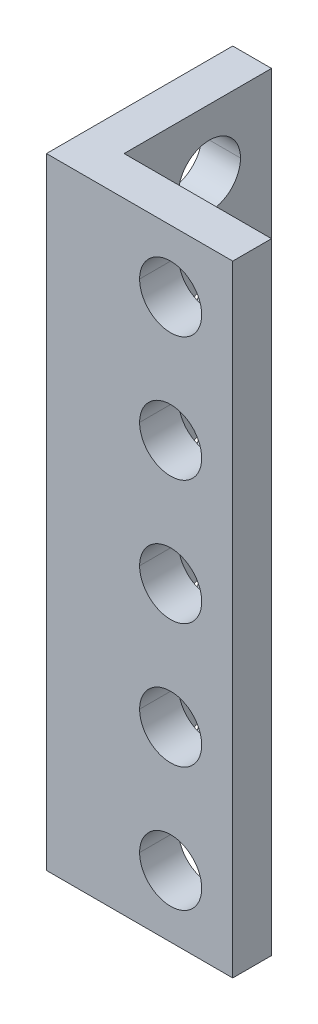
ISO-10303-21;
HEADER;
FILE_DESCRIPTION(('STEP AP214'),'2;1');
FILE_NAME('part.step','',(''),(''),'','','');
FILE_SCHEMA(('AUTOMOTIVE_DESIGN { 1 0 10303 214 1 1 1 1 }'));
ENDSEC;
DATA;
#1=APPLICATION_CONTEXT('core data for automotive mechanical design processes');
#2=APPLICATION_PROTOCOL_DEFINITION('international standard','automotive_design',2000,#1);
#3=PRODUCT_CONTEXT('',#1,'mechanical');
#4=PRODUCT('Part','Part','',(#3));
#5=PRODUCT_RELATED_PRODUCT_CATEGORY('part','',(#4));
#6=PRODUCT_DEFINITION_FORMATION('','',#4);
#7=PRODUCT_DEFINITION_CONTEXT('part definition',#1,'design');
#8=PRODUCT_DEFINITION('design','',#6,#7);
#9=PRODUCT_DEFINITION_SHAPE('','',#8);
#10=(LENGTH_UNIT() NAMED_UNIT(*) SI_UNIT(.MILLI.,.METRE.));
#11=(NAMED_UNIT(*) PLANE_ANGLE_UNIT() SI_UNIT($,.RADIAN.));
#12=(NAMED_UNIT(*) SI_UNIT($,.STERADIAN.) SOLID_ANGLE_UNIT());
#13=UNCERTAINTY_MEASURE_WITH_UNIT(LENGTH_MEASURE(1.E-05),#10,'distance_accuracy_value','');
#14=(GEOMETRIC_REPRESENTATION_CONTEXT(3) GLOBAL_UNCERTAINTY_ASSIGNED_CONTEXT((#13)) GLOBAL_UNIT_ASSIGNED_CONTEXT((#10,
#11,#12)) REPRESENTATION_CONTEXT('',''));
#15=CARTESIAN_POINT('',(0.,0.,0.));
#16=DIRECTION('',(0.,0.,1.));
#17=DIRECTION('',(1.,0.,0.));
#18=AXIS2_PLACEMENT_3D('',#15,#16,#17);
#19=CARTESIAN_POINT('',(12.,36.,-8.));
#20=DIRECTION('',(-1.,0.,0.));
#21=DIRECTION('',(0.,0.,1.));
#22=AXIS2_PLACEMENT_3D('',#19,#20,#21);
#23=CYLINDRICAL_SURFACE('',#22,2.);
#24=DIRECTION('',(-1.,0.,0.));
#25=VECTOR('',#24,1.);
#26=CARTESIAN_POINT('',(12.,36.,-10.));
#27=LINE('',#26,#25);
#28=CARTESIAN_POINT('',(2.5,36.,-10.));
#29=VERTEX_POINT('',#28);
#30=CARTESIAN_POINT('',(0.,36.,-10.));
#31=VERTEX_POINT('',#30);
#32=EDGE_CURVE('E372',#29,#31,#27,.T.);
#33=ORIENTED_EDGE('',*,*,#32,.F.);
#34=CARTESIAN_POINT('',(2.5,36.,-8.));
#35=DIRECTION('',(-1.,0.,0.));
#36=DIRECTION('',(0.,0.,1.));
#37=AXIS2_PLACEMENT_3D('',#34,#35,#36);
#38=CIRCLE('',#37,2.);
#39=CARTESIAN_POINT('',(2.5,36.,-6.));
#40=VERTEX_POINT('',#39);
#41=EDGE_CURVE('E350',#40,#29,#38,.T.);
#42=ORIENTED_EDGE('',*,*,#41,.F.);
#43=DIRECTION('',(-1.,0.,0.));
#44=VECTOR('',#43,1.);
#45=CARTESIAN_POINT('',(12.,36.,-6.));
#46=LINE('',#45,#44);
#47=CARTESIAN_POINT('',(0.,36.,-6.));
#48=VERTEX_POINT('',#47);
#49=EDGE_CURVE('E486',#40,#48,#46,.T.);
#50=ORIENTED_EDGE('',*,*,#49,.T.);
#51=CARTESIAN_POINT('',(0.,36.,-8.));
#52=DIRECTION('',(-1.,0.,0.));
#53=DIRECTION('',(0.,0.,1.));
#54=AXIS2_PLACEMENT_3D('',#51,#52,#53);
#55=CIRCLE('',#54,2.);
#56=EDGE_CURVE('E357',#48,#31,#55,.T.);
#57=ORIENTED_EDGE('',*,*,#56,.T.);
#58=EDGE_LOOP('',(#33,#42,#50,#57));
#59=FACE_BOUND('',#58,.T.);
#60=ADVANCED_FACE('F14',(#59),#23,.F.);
#61=CARTESIAN_POINT('',(12.,28.,-8.));
#62=DIRECTION('',(-1.,0.,0.));
#63=DIRECTION('',(0.,0.,1.));
#64=AXIS2_PLACEMENT_3D('',#61,#62,#63);
#65=CYLINDRICAL_SURFACE('',#64,2.);
#66=DIRECTION('',(-1.,0.,0.));
#67=VECTOR('',#66,1.);
#68=CARTESIAN_POINT('',(12.,28.,-10.));
#69=LINE('',#68,#67);
#70=CARTESIAN_POINT('',(2.5,28.,-10.));
#71=VERTEX_POINT('',#70);
#72=CARTESIAN_POINT('',(0.,28.,-10.));
#73=VERTEX_POINT('',#72);
#74=EDGE_CURVE('E358',#71,#73,#69,.T.);
#75=ORIENTED_EDGE('',*,*,#74,.F.);
#76=CARTESIAN_POINT('',(2.5,28.,-8.));
#77=DIRECTION('',(-1.,0.,0.));
#78=DIRECTION('',(0.,0.,1.));
#79=AXIS2_PLACEMENT_3D('',#76,#77,#78);
#80=CIRCLE('',#79,2.);
#81=CARTESIAN_POINT('',(2.5,28.,-6.));
#82=VERTEX_POINT('',#81);
#83=EDGE_CURVE('E287',#82,#71,#80,.T.);
#84=ORIENTED_EDGE('',*,*,#83,.F.);
#85=DIRECTION('',(-1.,0.,0.));
#86=VECTOR('',#85,1.);
#87=CARTESIAN_POINT('',(12.,28.,-6.));
#88=LINE('',#87,#86);
#89=CARTESIAN_POINT('',(0.,28.,-6.));
#90=VERTEX_POINT('',#89);
#91=EDGE_CURVE('E364',#82,#90,#88,.T.);
#92=ORIENTED_EDGE('',*,*,#91,.T.);
#93=CARTESIAN_POINT('',(0.,28.,-8.));
#94=DIRECTION('',(-1.,0.,0.));
#95=DIRECTION('',(0.,0.,1.));
#96=AXIS2_PLACEMENT_3D('',#93,#94,#95);
#97=CIRCLE('',#96,2.);
#98=EDGE_CURVE('E440',#90,#73,#97,.T.);
#99=ORIENTED_EDGE('',*,*,#98,.T.);
#100=EDGE_LOOP('',(#75,#84,#92,#99));
#101=FACE_BOUND('',#100,.T.);
#102=ADVANCED_FACE('F577',(#101),#65,.F.);
#103=CARTESIAN_POINT('',(12.,20.,-8.));
#104=DIRECTION('',(-1.,0.,0.));
#105=DIRECTION('',(0.,0.,1.));
#106=AXIS2_PLACEMENT_3D('',#103,#104,#105);
#107=CYLINDRICAL_SURFACE('',#106,2.);
#108=DIRECTION('',(-1.,0.,0.));
#109=VECTOR('',#108,1.);
#110=CARTESIAN_POINT('',(12.,20.,-10.));
#111=LINE('',#110,#109);
#112=CARTESIAN_POINT('',(2.5,20.,-10.));
#113=VERTEX_POINT('',#112);
#114=CARTESIAN_POINT('',(0.,20.,-10.));
#115=VERTEX_POINT('',#114);
#116=EDGE_CURVE('E336',#113,#115,#111,.T.);
#117=ORIENTED_EDGE('',*,*,#116,.F.);
#118=CARTESIAN_POINT('',(2.5,20.,-8.));
#119=DIRECTION('',(-1.,0.,0.));
#120=DIRECTION('',(0.,0.,1.));
#121=AXIS2_PLACEMENT_3D('',#118,#119,#120);
#122=CIRCLE('',#121,2.);
#123=CARTESIAN_POINT('',(2.5,20.,-6.));
#124=VERTEX_POINT('',#123);
#125=EDGE_CURVE('E257',#124,#113,#122,.T.);
#126=ORIENTED_EDGE('',*,*,#125,.F.);
#127=DIRECTION('',(-1.,0.,0.));
#128=VECTOR('',#127,1.);
#129=CARTESIAN_POINT('',(12.,20.,-6.));
#130=LINE('',#129,#128);
#131=CARTESIAN_POINT('',(0.,20.,-6.));
#132=VERTEX_POINT('',#131);
#133=EDGE_CURVE('E323',#124,#132,#130,.T.);
#134=ORIENTED_EDGE('',*,*,#133,.T.);
#135=CARTESIAN_POINT('',(0.,20.,-8.));
#136=DIRECTION('',(-1.,0.,0.));
#137=DIRECTION('',(0.,0.,1.));
#138=AXIS2_PLACEMENT_3D('',#135,#136,#137);
#139=CIRCLE('',#138,2.);
#140=EDGE_CURVE('E223',#132,#115,#139,.T.);
#141=ORIENTED_EDGE('',*,*,#140,.T.);
#142=EDGE_LOOP('',(#117,#126,#134,#141));
#143=FACE_BOUND('',#142,.T.);
#144=ADVANCED_FACE('F583',(#143),#107,.F.);
#145=CARTESIAN_POINT('',(12.,12.,-8.));
#146=DIRECTION('',(-1.,0.,0.));
#147=DIRECTION('',(0.,0.,1.));
#148=AXIS2_PLACEMENT_3D('',#145,#146,#147);
#149=CYLINDRICAL_SURFACE('',#148,2.);
#150=DIRECTION('',(-1.,0.,0.));
#151=VECTOR('',#150,1.);
#152=CARTESIAN_POINT('',(12.,12.,-10.));
#153=LINE('',#152,#151);
#154=CARTESIAN_POINT('',(2.5,12.,-10.));
#155=VERTEX_POINT('',#154);
#156=CARTESIAN_POINT('',(0.,12.,-10.));
#157=VERTEX_POINT('',#156);
#158=EDGE_CURVE('E288',#155,#157,#153,.T.);
#159=ORIENTED_EDGE('',*,*,#158,.F.);
#160=CARTESIAN_POINT('',(2.5,12.,-8.));
#161=DIRECTION('',(-1.,0.,0.));
#162=DIRECTION('',(0.,0.,1.));
#163=AXIS2_PLACEMENT_3D('',#160,#161,#162);
#164=CIRCLE('',#163,2.);
#165=CARTESIAN_POINT('',(2.5,12.,-6.));
#166=VERTEX_POINT('',#165);
#167=EDGE_CURVE('E211',#166,#155,#164,.T.);
#168=ORIENTED_EDGE('',*,*,#167,.F.);
#169=DIRECTION('',(-1.,0.,0.));
#170=VECTOR('',#169,1.);
#171=CARTESIAN_POINT('',(12.,12.,-6.));
#172=LINE('',#171,#170);
#173=CARTESIAN_POINT('',(0.,12.,-6.));
#174=VERTEX_POINT('',#173);
#175=EDGE_CURVE('E536',#166,#174,#172,.T.);
#176=ORIENTED_EDGE('',*,*,#175,.T.);
#177=CARTESIAN_POINT('',(0.,12.,-8.));
#178=DIRECTION('',(-1.,0.,0.));
#179=DIRECTION('',(0.,0.,1.));
#180=AXIS2_PLACEMENT_3D('',#177,#178,#179);
#181=CIRCLE('',#180,2.);
#182=EDGE_CURVE('E446',#174,#157,#181,.T.);
#183=ORIENTED_EDGE('',*,*,#182,.T.);
#184=EDGE_LOOP('',(#159,#168,#176,#183));
#185=FACE_BOUND('',#184,.T.);
#186=ADVANCED_FACE('F609',(#185),#149,.F.);
#187=CARTESIAN_POINT('',(8.,36.,-12.));
#188=DIRECTION('',(0.,0.,1.));
#189=DIRECTION('',(1.,0.,0.));
#190=AXIS2_PLACEMENT_3D('',#187,#188,#189);
#191=CYLINDRICAL_SURFACE('',#190,2.);
#192=DIRECTION('',(0.,0.,1.));
#193=VECTOR('',#192,1.);
#194=CARTESIAN_POINT('',(6.,36.,-12.));
#195=LINE('',#194,#193);
#196=CARTESIAN_POINT('',(6.,36.,-2.5));
#197=VERTEX_POINT('',#196);
#198=CARTESIAN_POINT('',(6.,36.,0.));
#199=VERTEX_POINT('',#198);
#200=EDGE_CURVE('E377',#197,#199,#195,.T.);
#201=ORIENTED_EDGE('',*,*,#200,.F.);
#202=CARTESIAN_POINT('',(8.,36.,-2.5));
#203=DIRECTION('',(0.,0.,1.));
#204=DIRECTION('',(-1.,0.,0.));
#205=AXIS2_PLACEMENT_3D('',#202,#203,#204);
#206=CIRCLE('',#205,2.);
#207=CARTESIAN_POINT('',(10.,36.,-2.50000000000004));
#208=VERTEX_POINT('',#207);
#209=EDGE_CURVE('E343',#208,#197,#206,.T.);
#210=ORIENTED_EDGE('',*,*,#209,.F.);
#211=DIRECTION('',(0.,0.,1.));
#212=VECTOR('',#211,1.);
#213=CARTESIAN_POINT('',(10.,36.,-12.));
#214=LINE('',#213,#212);
#215=CARTESIAN_POINT('',(10.,36.,0.));
#216=VERTEX_POINT('',#215);
#217=EDGE_CURVE('E395',#208,#216,#214,.T.);
#218=ORIENTED_EDGE('',*,*,#217,.T.);
#219=CARTESIAN_POINT('',(8.,36.,0.));
#220=DIRECTION('',(0.,0.,-1.));
#221=DIRECTION('',(-1.,0.,0.));
#222=AXIS2_PLACEMENT_3D('',#219,#220,#221);
#223=CIRCLE('',#222,2.);
#224=EDGE_CURVE('E309',#199,#216,#223,.T.);
#225=ORIENTED_EDGE('',*,*,#224,.F.);
#226=EDGE_LOOP('',(#201,#210,#218,#225));
#227=FACE_BOUND('',#226,.T.);
#228=ADVANCED_FACE('F606',(#227),#191,.F.);
#229=CARTESIAN_POINT('',(8.,28.,-12.));
#230=DIRECTION('',(0.,0.,1.));
#231=DIRECTION('',(1.,0.,0.));
#232=AXIS2_PLACEMENT_3D('',#229,#230,#231);
#233=CYLINDRICAL_SURFACE('',#232,2.);
#234=DIRECTION('',(0.,0.,1.));
#235=VECTOR('',#234,1.);
#236=CARTESIAN_POINT('',(6.,28.,-12.));
#237=LINE('',#236,#235);
#238=CARTESIAN_POINT('',(6.,28.,-2.5));
#239=VERTEX_POINT('',#238);
#240=CARTESIAN_POINT('',(6.,28.,0.));
#241=VERTEX_POINT('',#240);
#242=EDGE_CURVE('E18',#239,#241,#237,.T.);
#243=ORIENTED_EDGE('',*,*,#242,.F.);
#244=CARTESIAN_POINT('',(8.,28.,-2.5));
#245=DIRECTION('',(0.,0.,1.));
#246=DIRECTION('',(-1.,0.,0.));
#247=AXIS2_PLACEMENT_3D('',#244,#245,#246);
#248=CIRCLE('',#247,2.);
#249=CARTESIAN_POINT('',(10.,28.,-2.50000000000004));
#250=VERTEX_POINT('',#249);
#251=EDGE_CURVE('E331',#250,#239,#248,.T.);
#252=ORIENTED_EDGE('',*,*,#251,.F.);
#253=DIRECTION('',(0.,0.,1.));
#254=VECTOR('',#253,1.);
#255=CARTESIAN_POINT('',(10.,28.,-12.));
#256=LINE('',#255,#254);
#257=CARTESIAN_POINT('',(10.,28.,0.));
#258=VERTEX_POINT('',#257);
#259=EDGE_CURVE('E499',#250,#258,#256,.T.);
#260=ORIENTED_EDGE('',*,*,#259,.T.);
#261=CARTESIAN_POINT('',(8.,28.,0.));
#262=DIRECTION('',(0.,0.,-1.));
#263=DIRECTION('',(-1.,0.,0.));
#264=AXIS2_PLACEMENT_3D('',#261,#262,#263);
#265=CIRCLE('',#264,2.);
#266=EDGE_CURVE('E351',#241,#258,#265,.T.);
#267=ORIENTED_EDGE('',*,*,#266,.F.);
#268=EDGE_LOOP('',(#243,#252,#260,#267));
#269=FACE_BOUND('',#268,.T.);
#270=ADVANCED_FACE('F608',(#269),#233,.F.);
#271=CARTESIAN_POINT('',(8.,20.,-12.));
#272=DIRECTION('',(0.,0.,1.));
#273=DIRECTION('',(1.,0.,0.));
#274=AXIS2_PLACEMENT_3D('',#271,#272,#273);
#275=CYLINDRICAL_SURFACE('',#274,2.);
#276=DIRECTION('',(0.,0.,1.));
#277=VECTOR('',#276,1.);
#278=CARTESIAN_POINT('',(6.,20.,-12.));
#279=LINE('',#278,#277);
#280=CARTESIAN_POINT('',(6.,20.,-2.5));
#281=VERTEX_POINT('',#280);
#282=CARTESIAN_POINT('',(6.,20.,0.));
#283=VERTEX_POINT('',#282);
#284=EDGE_CURVE('E376',#281,#283,#279,.T.);
#285=ORIENTED_EDGE('',*,*,#284,.F.);
#286=CARTESIAN_POINT('',(8.,20.,-2.5));
#287=DIRECTION('',(0.,0.,1.));
#288=DIRECTION('',(-1.,0.,0.));
#289=AXIS2_PLACEMENT_3D('',#286,#287,#288);
#290=CIRCLE('',#289,2.);
#291=CARTESIAN_POINT('',(10.,20.,-2.50000000000004));
#292=VERTEX_POINT('',#291);
#293=EDGE_CURVE('E341',#292,#281,#290,.T.);
#294=ORIENTED_EDGE('',*,*,#293,.F.);
#295=DIRECTION('',(0.,0.,1.));
#296=VECTOR('',#295,1.);
#297=CARTESIAN_POINT('',(10.,20.,-12.));
#298=LINE('',#297,#296);
#299=CARTESIAN_POINT('',(10.,20.,0.));
#300=VERTEX_POINT('',#299);
#301=EDGE_CURVE('E310',#292,#300,#298,.T.);
#302=ORIENTED_EDGE('',*,*,#301,.T.);
#303=CARTESIAN_POINT('',(8.,20.,0.));
#304=DIRECTION('',(0.,0.,-1.));
#305=DIRECTION('',(-1.,0.,0.));
#306=AXIS2_PLACEMENT_3D('',#303,#304,#305);
#307=CIRCLE('',#306,2.);
#308=EDGE_CURVE('E354',#283,#300,#307,.T.);
#309=ORIENTED_EDGE('',*,*,#308,.F.);
#310=EDGE_LOOP('',(#285,#294,#302,#309));
#311=FACE_BOUND('',#310,.T.);
#312=ADVANCED_FACE('F612',(#311),#275,.F.);
#313=CARTESIAN_POINT('',(8.,12.,-12.));
#314=DIRECTION('',(0.,0.,1.));
#315=DIRECTION('',(1.,0.,0.));
#316=AXIS2_PLACEMENT_3D('',#313,#314,#315);
#317=CYLINDRICAL_SURFACE('',#316,2.);
#318=DIRECTION('',(0.,0.,1.));
#319=VECTOR('',#318,1.);
#320=CARTESIAN_POINT('',(6.,12.,-12.));
#321=LINE('',#320,#319);
#322=CARTESIAN_POINT('',(6.,12.,-2.5));
#323=VERTEX_POINT('',#322);
#324=CARTESIAN_POINT('',(6.,12.,0.));
#325=VERTEX_POINT('',#324);
#326=EDGE_CURVE('E398',#323,#325,#321,.T.);
#327=ORIENTED_EDGE('',*,*,#326,.F.);
#328=CARTESIAN_POINT('',(8.,12.,-2.5));
#329=DIRECTION('',(0.,0.,1.));
#330=DIRECTION('',(-1.,0.,0.));
#331=AXIS2_PLACEMENT_3D('',#328,#329,#330);
#332=CIRCLE('',#331,2.);
#333=CARTESIAN_POINT('',(10.,12.,-2.50000000000004));
#334=VERTEX_POINT('',#333);
#335=EDGE_CURVE('E334',#334,#323,#332,.T.);
#336=ORIENTED_EDGE('',*,*,#335,.F.);
#337=DIRECTION('',(0.,0.,1.));
#338=VECTOR('',#337,1.);
#339=CARTESIAN_POINT('',(10.,12.,-12.));
#340=LINE('',#339,#338);
#341=CARTESIAN_POINT('',(10.,12.,0.));
#342=VERTEX_POINT('',#341);
#343=EDGE_CURVE('E433',#334,#342,#340,.T.);
#344=ORIENTED_EDGE('',*,*,#343,.T.);
#345=CARTESIAN_POINT('',(8.,12.,0.));
#346=DIRECTION('',(0.,0.,-1.));
#347=DIRECTION('',(-1.,0.,0.));
#348=AXIS2_PLACEMENT_3D('',#345,#346,#347);
#349=CIRCLE('',#348,2.);
#350=EDGE_CURVE('E330',#325,#342,#349,.T.);
#351=ORIENTED_EDGE('',*,*,#350,.F.);
#352=EDGE_LOOP('',(#327,#336,#344,#351));
#353=FACE_BOUND('',#352,.T.);
#354=ADVANCED_FACE('F615',(#353),#317,.F.);
#355=CARTESIAN_POINT('',(0.,40.,0.));
#356=DIRECTION('',(0.,1.,0.));
#357=DIRECTION('',(1.,0.,0.));
#358=AXIS2_PLACEMENT_3D('',#355,#356,#357);
#359=PLANE('',#358);
#360=DIRECTION('',(1.,0.,0.));
#361=VECTOR('',#360,1.);
#362=CARTESIAN_POINT('',(0.,40.,-2.5));
#363=LINE('',#362,#361);
#364=CARTESIAN_POINT('',(2.5,40.,-2.5));
#365=VERTEX_POINT('',#364);
#366=CARTESIAN_POINT('',(12.,40.,-2.50000000000005));
#367=VERTEX_POINT('',#366);
#368=EDGE_CURVE('E403',#365,#367,#363,.T.);
#369=ORIENTED_EDGE('',*,*,#368,.F.);
#370=DIRECTION('',(0.,0.,-1.));
#371=VECTOR('',#370,1.);
#372=CARTESIAN_POINT('',(2.5,40.,0.));
#373=LINE('',#372,#371);
#374=CARTESIAN_POINT('',(2.5,40.,-12.));
#375=VERTEX_POINT('',#374);
#376=EDGE_CURVE('E408',#365,#375,#373,.T.);
#377=ORIENTED_EDGE('',*,*,#376,.T.);
#378=DIRECTION('',(1.,0.,0.));
#379=VECTOR('',#378,1.);
#380=CARTESIAN_POINT('',(0.,40.,-12.));
#381=LINE('',#380,#379);
#382=CARTESIAN_POINT('',(0.,40.,-12.));
#383=VERTEX_POINT('',#382);
#384=EDGE_CURVE('E303',#383,#375,#381,.T.);
#385=ORIENTED_EDGE('',*,*,#384,.F.);
#386=DIRECTION('',(0.,0.,-1.));
#387=VECTOR('',#386,1.);
#388=CARTESIAN_POINT('',(0.,40.,0.));
#389=LINE('',#388,#387);
#390=CARTESIAN_POINT('',(0.,40.,0.));
#391=VERTEX_POINT('',#390);
#392=EDGE_CURVE('E40',#391,#383,#389,.T.);
#393=ORIENTED_EDGE('',*,*,#392,.F.);
#394=DIRECTION('',(1.,0.,0.));
#395=VECTOR('',#394,1.);
#396=CARTESIAN_POINT('',(0.,40.,0.));
#397=LINE('',#396,#395);
#398=CARTESIAN_POINT('',(12.,40.,0.));
#399=VERTEX_POINT('',#398);
#400=EDGE_CURVE('E294',#391,#399,#397,.T.);
#401=ORIENTED_EDGE('',*,*,#400,.T.);
#402=DIRECTION('',(0.,0.,-1.));
#403=VECTOR('',#402,1.);
#404=CARTESIAN_POINT('',(12.,40.,0.));
#405=LINE('',#404,#403);
#406=EDGE_CURVE('E9',#399,#367,#405,.T.);
#407=ORIENTED_EDGE('',*,*,#406,.T.);
#408=EDGE_LOOP('',(#369,#377,#385,#393,#401,#407));
#409=FACE_BOUND('',#408,.T.);
#410=ADVANCED_FACE('F559',(#409),#359,.T.);
#411=CARTESIAN_POINT('',(8.,4.,-12.));
#412=DIRECTION('',(0.,0.,1.));
#413=DIRECTION('',(1.,0.,0.));
#414=AXIS2_PLACEMENT_3D('',#411,#412,#413);
#415=CYLINDRICAL_SURFACE('',#414,2.);
#416=DIRECTION('',(0.,0.,1.));
#417=VECTOR('',#416,1.);
#418=CARTESIAN_POINT('',(6.,4.,-12.));
#419=LINE('',#418,#417);
#420=CARTESIAN_POINT('',(6.,4.,-2.5));
#421=VERTEX_POINT('',#420);
#422=CARTESIAN_POINT('',(6.,4.,0.));
#423=VERTEX_POINT('',#422);
#424=EDGE_CURVE('E432',#421,#423,#419,.T.);
#425=ORIENTED_EDGE('',*,*,#424,.F.);
#426=CARTESIAN_POINT('',(8.,4.,-2.5));
#427=DIRECTION('',(0.,0.,1.));
#428=DIRECTION('',(-1.,0.,0.));
#429=AXIS2_PLACEMENT_3D('',#426,#427,#428);
#430=CIRCLE('',#429,2.);
#431=CARTESIAN_POINT('',(10.,4.,-2.50000000000004));
#432=VERTEX_POINT('',#431);
#433=EDGE_CURVE('E344',#432,#421,#430,.T.);
#434=ORIENTED_EDGE('',*,*,#433,.F.);
#435=DIRECTION('',(0.,0.,1.));
#436=VECTOR('',#435,1.);
#437=CARTESIAN_POINT('',(10.,4.,-12.));
#438=LINE('',#437,#436);
#439=CARTESIAN_POINT('',(10.,4.,0.));
#440=VERTEX_POINT('',#439);
#441=EDGE_CURVE('E272',#432,#440,#438,.T.);
#442=ORIENTED_EDGE('',*,*,#441,.T.);
#443=CARTESIAN_POINT('',(8.,4.,0.));
#444=DIRECTION('',(0.,0.,-1.));
#445=DIRECTION('',(-1.,0.,0.));
#446=AXIS2_PLACEMENT_3D('',#443,#444,#445);
#447=CIRCLE('',#446,2.);
#448=EDGE_CURVE('E327',#423,#440,#447,.T.);
#449=ORIENTED_EDGE('',*,*,#448,.F.);
#450=EDGE_LOOP('',(#425,#434,#442,#449));
#451=FACE_BOUND('',#450,.T.);
#452=ADVANCED_FACE('F602',(#451),#415,.F.);
#453=CARTESIAN_POINT('',(12.,4.,-8.));
#454=DIRECTION('',(-1.,0.,0.));
#455=DIRECTION('',(0.,0.,1.));
#456=AXIS2_PLACEMENT_3D('',#453,#454,#455);
#457=CYLINDRICAL_SURFACE('',#456,2.);
#458=DIRECTION('',(-1.,0.,0.));
#459=VECTOR('',#458,1.);
#460=CARTESIAN_POINT('',(12.,4.,-10.));
#461=LINE('',#460,#459);
#462=CARTESIAN_POINT('',(2.5,4.,-10.));
#463=VERTEX_POINT('',#462);
#464=CARTESIAN_POINT('',(0.,4.,-10.));
#465=VERTEX_POINT('',#464);
#466=EDGE_CURVE('E260',#463,#465,#461,.T.);
#467=ORIENTED_EDGE('',*,*,#466,.F.);
#468=CARTESIAN_POINT('',(2.5,4.,-8.));
#469=DIRECTION('',(-1.,0.,0.));
#470=DIRECTION('',(0.,0.,1.));
#471=AXIS2_PLACEMENT_3D('',#468,#469,#470);
#472=CIRCLE('',#471,2.);
#473=CARTESIAN_POINT('',(2.5,4.,-6.));
#474=VERTEX_POINT('',#473);
#475=EDGE_CURVE('E249',#474,#463,#472,.T.);
#476=ORIENTED_EDGE('',*,*,#475,.F.);
#477=DIRECTION('',(-1.,0.,0.));
#478=VECTOR('',#477,1.);
#479=CARTESIAN_POINT('',(12.,4.,-6.));
#480=LINE('',#479,#478);
#481=CARTESIAN_POINT('',(0.,4.,-6.));
#482=VERTEX_POINT('',#481);
#483=EDGE_CURVE('E270',#474,#482,#480,.T.);
#484=ORIENTED_EDGE('',*,*,#483,.T.);
#485=CARTESIAN_POINT('',(0.,4.,-8.));
#486=DIRECTION('',(-1.,0.,0.));
#487=DIRECTION('',(0.,0.,1.));
#488=AXIS2_PLACEMENT_3D('',#485,#486,#487);
#489=CIRCLE('',#488,2.);
#490=EDGE_CURVE('E262',#482,#465,#489,.T.);
#491=ORIENTED_EDGE('',*,*,#490,.T.);
#492=EDGE_LOOP('',(#467,#476,#484,#491));
#493=FACE_BOUND('',#492,.T.);
#494=ADVANCED_FACE('F261',(#493),#457,.F.);
#495=CARTESIAN_POINT('',(0.,0.,0.));
#496=DIRECTION('',(0.,1.,0.));
#497=DIRECTION('',(1.,0.,0.));
#498=AXIS2_PLACEMENT_3D('',#495,#496,#497);
#499=PLANE('',#498);
#500=DIRECTION('',(1.,0.,0.));
#501=VECTOR('',#500,1.);
#502=CARTESIAN_POINT('',(0.,0.,-2.5));
#503=LINE('',#502,#501);
#504=CARTESIAN_POINT('',(2.5,0.,-2.5));
#505=VERTEX_POINT('',#504);
#506=CARTESIAN_POINT('',(12.,0.,-2.50000000000005));
#507=VERTEX_POINT('',#506);
#508=EDGE_CURVE('E316',#505,#507,#503,.T.);
#509=ORIENTED_EDGE('',*,*,#508,.T.);
#510=DIRECTION('',(0.,0.,-1.));
#511=VECTOR('',#510,1.);
#512=CARTESIAN_POINT('',(12.,0.,0.));
#513=LINE('',#512,#511);
#514=CARTESIAN_POINT('',(12.,0.,0.));
#515=VERTEX_POINT('',#514);
#516=EDGE_CURVE('E25',#515,#507,#513,.T.);
#517=ORIENTED_EDGE('',*,*,#516,.F.);
#518=DIRECTION('',(1.,0.,0.));
#519=VECTOR('',#518,1.);
#520=CARTESIAN_POINT('',(0.,0.,0.));
#521=LINE('',#520,#519);
#522=CARTESIAN_POINT('',(0.,0.,0.));
#523=VERTEX_POINT('',#522);
#524=EDGE_CURVE('E451',#523,#515,#521,.T.);
#525=ORIENTED_EDGE('',*,*,#524,.F.);
#526=DIRECTION('',(0.,0.,-1.));
#527=VECTOR('',#526,1.);
#528=CARTESIAN_POINT('',(0.,0.,0.));
#529=LINE('',#528,#527);
#530=CARTESIAN_POINT('',(0.,0.,-12.));
#531=VERTEX_POINT('',#530);
#532=EDGE_CURVE('E300',#523,#531,#529,.T.);
#533=ORIENTED_EDGE('',*,*,#532,.T.);
#534=DIRECTION('',(1.,0.,0.));
#535=VECTOR('',#534,1.);
#536=CARTESIAN_POINT('',(0.,0.,-12.));
#537=LINE('',#536,#535);
#538=CARTESIAN_POINT('',(2.5,0.,-12.));
#539=VERTEX_POINT('',#538);
#540=EDGE_CURVE('E346',#531,#539,#537,.T.);
#541=ORIENTED_EDGE('',*,*,#540,.T.);
#542=DIRECTION('',(0.,0.,-1.));
#543=VECTOR('',#542,1.);
#544=CARTESIAN_POINT('',(2.5,0.,0.));
#545=LINE('',#544,#543);
#546=EDGE_CURVE('E304',#505,#539,#545,.T.);
#547=ORIENTED_EDGE('',*,*,#546,.F.);
#548=EDGE_LOOP('',(#509,#517,#525,#533,#541,#547));
#549=FACE_BOUND('',#548,.T.);
#550=ADVANCED_FACE('F554',(#549),#499,.F.);
#551=CARTESIAN_POINT('',(12.,8.,0.));
#552=DIRECTION('',(-1.,0.,0.));
#553=DIRECTION('',(0.,1.,0.));
#554=AXIS2_PLACEMENT_3D('',#551,#552,#553);
#555=PLANE('',#554);
#556=ORIENTED_EDGE('',*,*,#516,.T.);
#557=DIRECTION('',(0.,-1.,0.));
#558=VECTOR('',#557,1.);
#559=CARTESIAN_POINT('',(12.,8.,-2.50000000000005));
#560=LINE('',#559,#558);
#561=EDGE_CURVE('E335',#367,#507,#560,.T.);
#562=ORIENTED_EDGE('',*,*,#561,.F.);
#563=ORIENTED_EDGE('',*,*,#406,.F.);
#564=DIRECTION('',(0.,-1.,0.));
#565=VECTOR('',#564,1.);
#566=CARTESIAN_POINT('',(12.,8.,0.));
#567=LINE('',#566,#565);
#568=EDGE_CURVE('E299',#399,#515,#567,.T.);
#569=ORIENTED_EDGE('',*,*,#568,.T.);
#570=EDGE_LOOP('',(#556,#562,#563,#569));
#571=FACE_BOUND('',#570,.T.);
#572=ADVANCED_FACE('F558',(#571),#555,.F.);
#573=CARTESIAN_POINT('',(0.,8.,0.));
#574=DIRECTION('',(-1.,0.,0.));
#575=DIRECTION('',(0.,0.,1.));
#576=AXIS2_PLACEMENT_3D('',#573,#574,#575);
#577=PLANE('',#576);
#578=ORIENTED_EDGE('',*,*,#56,.F.);
#579=CARTESIAN_POINT('',(0.,36.,-8.));
#580=DIRECTION('',(-1.,0.,0.));
#581=DIRECTION('',(0.,0.,1.));
#582=AXIS2_PLACEMENT_3D('',#579,#580,#581);
#583=CIRCLE('',#582,2.);
#584=EDGE_CURVE('E386',#31,#48,#583,.T.);
#585=ORIENTED_EDGE('',*,*,#584,.F.);
#586=EDGE_LOOP('',(#578,#585));
#587=FACE_BOUND('',#586,.T.);
#588=ORIENTED_EDGE('',*,*,#98,.F.);
#589=CARTESIAN_POINT('',(0.,28.,-8.));
#590=DIRECTION('',(-1.,0.,0.));
#591=DIRECTION('',(0.,0.,1.));
#592=AXIS2_PLACEMENT_3D('',#589,#590,#591);
#593=CIRCLE('',#592,2.);
#594=EDGE_CURVE('E362',#73,#90,#593,.T.);
#595=ORIENTED_EDGE('',*,*,#594,.F.);
#596=EDGE_LOOP('',(#588,#595));
#597=FACE_BOUND('',#596,.T.);
#598=ORIENTED_EDGE('',*,*,#140,.F.);
#599=CARTESIAN_POINT('',(0.,20.,-8.));
#600=DIRECTION('',(-1.,0.,0.));
#601=DIRECTION('',(0.,0.,1.));
#602=AXIS2_PLACEMENT_3D('',#599,#600,#601);
#603=CIRCLE('',#602,2.);
#604=EDGE_CURVE('E326',#115,#132,#603,.T.);
#605=ORIENTED_EDGE('',*,*,#604,.F.);
#606=EDGE_LOOP('',(#598,#605));
#607=FACE_BOUND('',#606,.T.);
#608=ORIENTED_EDGE('',*,*,#490,.F.);
#609=CARTESIAN_POINT('',(0.,4.,-8.));
#610=DIRECTION('',(-1.,0.,0.));
#611=DIRECTION('',(0.,0.,1.));
#612=AXIS2_PLACEMENT_3D('',#609,#610,#611);
#613=CIRCLE('',#612,2.);
#614=EDGE_CURVE('E267',#465,#482,#613,.T.);
#615=ORIENTED_EDGE('',*,*,#614,.F.);
#616=EDGE_LOOP('',(#608,#615));
#617=FACE_BOUND('',#616,.T.);
#618=ORIENTED_EDGE('',*,*,#182,.F.);
#619=CARTESIAN_POINT('',(0.,12.,-8.));
#620=DIRECTION('',(-1.,0.,0.));
#621=DIRECTION('',(0.,0.,1.));
#622=AXIS2_PLACEMENT_3D('',#619,#620,#621);
#623=CIRCLE('',#622,2.);
#624=EDGE_CURVE('E292',#157,#174,#623,.T.);
#625=ORIENTED_EDGE('',*,*,#624,.F.);
#626=EDGE_LOOP('',(#618,#625));
#627=FACE_BOUND('',#626,.T.);
#628=ORIENTED_EDGE('',*,*,#532,.F.);
#629=DIRECTION('',(0.,-1.,0.));
#630=VECTOR('',#629,1.);
#631=CARTESIAN_POINT('',(0.,8.,0.));
#632=LINE('',#631,#630);
#633=EDGE_CURVE('E298',#391,#523,#632,.T.);
#634=ORIENTED_EDGE('',*,*,#633,.F.);
#635=ORIENTED_EDGE('',*,*,#392,.T.);
#636=DIRECTION('',(0.,-1.,0.));
#637=VECTOR('',#636,1.);
#638=CARTESIAN_POINT('',(0.,8.,-12.));
#639=LINE('',#638,#637);
#640=EDGE_CURVE('E349',#383,#531,#639,.T.);
#641=ORIENTED_EDGE('',*,*,#640,.T.);
#642=EDGE_LOOP('',(#628,#634,#635,#641));
#643=FACE_BOUND('',#642,.T.);
#644=ADVANCED_FACE('F562',(#587,#597,#607,#617,#627,#643),#577,.T.);
#645=CARTESIAN_POINT('',(0.,8.,-12.));
#646=DIRECTION('',(0.,0.,-1.));
#647=DIRECTION('',(0.,-1.,0.));
#648=AXIS2_PLACEMENT_3D('',#645,#646,#647);
#649=PLANE('',#648);
#650=ORIENTED_EDGE('',*,*,#540,.F.);
#651=ORIENTED_EDGE('',*,*,#640,.F.);
#652=ORIENTED_EDGE('',*,*,#384,.T.);
#653=DIRECTION('',(0.,-1.,0.));
#654=VECTOR('',#653,1.);
#655=CARTESIAN_POINT('',(2.5,8.,-12.));
#656=LINE('',#655,#654);
#657=EDGE_CURVE('E308',#375,#539,#656,.T.);
#658=ORIENTED_EDGE('',*,*,#657,.T.);
#659=EDGE_LOOP('',(#650,#651,#652,#658));
#660=FACE_BOUND('',#659,.T.);
#661=ADVANCED_FACE('F561',(#660),#649,.T.);
#662=CARTESIAN_POINT('',(2.5,8.,0.));
#663=DIRECTION('',(-1.,0.,0.));
#664=DIRECTION('',(0.,0.,1.));
#665=AXIS2_PLACEMENT_3D('',#662,#663,#664);
#666=PLANE('',#665);
#667=ORIENTED_EDGE('',*,*,#41,.T.);
#668=CARTESIAN_POINT('',(2.5,36.,-8.));
#669=DIRECTION('',(-1.,0.,0.));
#670=DIRECTION('',(0.,0.,1.));
#671=AXIS2_PLACEMENT_3D('',#668,#669,#670);
#672=CIRCLE('',#671,2.);
#673=EDGE_CURVE('E368',#29,#40,#672,.T.);
#674=ORIENTED_EDGE('',*,*,#673,.T.);
#675=EDGE_LOOP('',(#667,#674));
#676=FACE_BOUND('',#675,.T.);
#677=ORIENTED_EDGE('',*,*,#83,.T.);
#678=CARTESIAN_POINT('',(2.5,28.,-8.));
#679=DIRECTION('',(-1.,0.,0.));
#680=DIRECTION('',(0.,0.,1.));
#681=AXIS2_PLACEMENT_3D('',#678,#679,#680);
#682=CIRCLE('',#681,2.);
#683=EDGE_CURVE('E363',#71,#82,#682,.T.);
#684=ORIENTED_EDGE('',*,*,#683,.T.);
#685=EDGE_LOOP('',(#677,#684));
#686=FACE_BOUND('',#685,.T.);
#687=ORIENTED_EDGE('',*,*,#125,.T.);
#688=CARTESIAN_POINT('',(2.5,20.,-8.));
#689=DIRECTION('',(-1.,0.,0.));
#690=DIRECTION('',(0.,0.,1.));
#691=AXIS2_PLACEMENT_3D('',#688,#689,#690);
#692=CIRCLE('',#691,2.);
#693=EDGE_CURVE('E340',#113,#124,#692,.T.);
#694=ORIENTED_EDGE('',*,*,#693,.T.);
#695=EDGE_LOOP('',(#687,#694));
#696=FACE_BOUND('',#695,.T.);
#697=ORIENTED_EDGE('',*,*,#475,.T.);
#698=CARTESIAN_POINT('',(2.5,4.,-8.));
#699=DIRECTION('',(-1.,0.,0.));
#700=DIRECTION('',(0.,0.,1.));
#701=AXIS2_PLACEMENT_3D('',#698,#699,#700);
#702=CIRCLE('',#701,2.);
#703=EDGE_CURVE('E252',#463,#474,#702,.T.);
#704=ORIENTED_EDGE('',*,*,#703,.T.);
#705=EDGE_LOOP('',(#697,#704));
#706=FACE_BOUND('',#705,.T.);
#707=ORIENTED_EDGE('',*,*,#167,.T.);
#708=CARTESIAN_POINT('',(2.5,12.,-8.));
#709=DIRECTION('',(-1.,0.,0.));
#710=DIRECTION('',(0.,0.,1.));
#711=AXIS2_PLACEMENT_3D('',#708,#709,#710);
#712=CIRCLE('',#711,2.);
#713=EDGE_CURVE('E293',#155,#166,#712,.T.);
#714=ORIENTED_EDGE('',*,*,#713,.T.);
#715=EDGE_LOOP('',(#707,#714));
#716=FACE_BOUND('',#715,.T.);
#717=ORIENTED_EDGE('',*,*,#546,.T.);
#718=ORIENTED_EDGE('',*,*,#657,.F.);
#719=ORIENTED_EDGE('',*,*,#376,.F.);
#720=DIRECTION('',(0.,-1.,0.));
#721=VECTOR('',#720,1.);
#722=CARTESIAN_POINT('',(2.5,8.,-2.5));
#723=LINE('',#722,#721);
#724=EDGE_CURVE('E320',#365,#505,#723,.T.);
#725=ORIENTED_EDGE('',*,*,#724,.T.);
#726=EDGE_LOOP('',(#717,#718,#719,#725));
#727=FACE_BOUND('',#726,.T.);
#728=ADVANCED_FACE('F16',(#676,#686,#696,#706,#716,#727),#666,.F.);
#729=CARTESIAN_POINT('',(0.,8.,0.));
#730=DIRECTION('',(0.,0.,-1.));
#731=DIRECTION('',(-1.,0.,0.));
#732=AXIS2_PLACEMENT_3D('',#729,#730,#731);
#733=PLANE('',#732);
#734=CARTESIAN_POINT('',(8.,36.,0.));
#735=DIRECTION('',(0.,0.,-1.));
#736=DIRECTION('',(-1.,0.,0.));
#737=AXIS2_PLACEMENT_3D('',#734,#735,#736);
#738=CIRCLE('',#737,2.);
#739=EDGE_CURVE('E381',#216,#199,#738,.T.);
#740=ORIENTED_EDGE('',*,*,#739,.T.);
#741=ORIENTED_EDGE('',*,*,#224,.T.);
#742=EDGE_LOOP('',(#740,#741));
#743=FACE_BOUND('',#742,.T.);
#744=CARTESIAN_POINT('',(8.,28.,0.));
#745=DIRECTION('',(0.,0.,-1.));
#746=DIRECTION('',(-1.,0.,0.));
#747=AXIS2_PLACEMENT_3D('',#744,#745,#746);
#748=CIRCLE('',#747,2.);
#749=EDGE_CURVE('E503',#258,#241,#748,.T.);
#750=ORIENTED_EDGE('',*,*,#749,.T.);
#751=ORIENTED_EDGE('',*,*,#266,.T.);
#752=EDGE_LOOP('',(#750,#751));
#753=FACE_BOUND('',#752,.T.);
#754=CARTESIAN_POINT('',(8.,20.,0.));
#755=DIRECTION('',(0.,0.,-1.));
#756=DIRECTION('',(-1.,0.,0.));
#757=AXIS2_PLACEMENT_3D('',#754,#755,#756);
#758=CIRCLE('',#757,2.);
#759=EDGE_CURVE('E315',#300,#283,#758,.T.);
#760=ORIENTED_EDGE('',*,*,#759,.T.);
#761=ORIENTED_EDGE('',*,*,#308,.T.);
#762=EDGE_LOOP('',(#760,#761));
#763=FACE_BOUND('',#762,.T.);
#764=CARTESIAN_POINT('',(8.,12.,0.));
#765=DIRECTION('',(0.,0.,-1.));
#766=DIRECTION('',(-1.,0.,0.));
#767=AXIS2_PLACEMENT_3D('',#764,#765,#766);
#768=CIRCLE('',#767,2.);
#769=EDGE_CURVE('E402',#342,#325,#768,.T.);
#770=ORIENTED_EDGE('',*,*,#769,.T.);
#771=ORIENTED_EDGE('',*,*,#350,.T.);
#772=EDGE_LOOP('',(#770,#771));
#773=FACE_BOUND('',#772,.T.);
#774=CARTESIAN_POINT('',(8.,4.,0.));
#775=DIRECTION('',(0.,0.,-1.));
#776=DIRECTION('',(-1.,0.,0.));
#777=AXIS2_PLACEMENT_3D('',#774,#775,#776);
#778=CIRCLE('',#777,2.);
#779=EDGE_CURVE('E280',#440,#423,#778,.T.);
#780=ORIENTED_EDGE('',*,*,#779,.T.);
#781=ORIENTED_EDGE('',*,*,#448,.T.);
#782=EDGE_LOOP('',(#780,#781));
#783=FACE_BOUND('',#782,.T.);
#784=ORIENTED_EDGE('',*,*,#524,.T.);
#785=ORIENTED_EDGE('',*,*,#568,.F.);
#786=ORIENTED_EDGE('',*,*,#400,.F.);
#787=ORIENTED_EDGE('',*,*,#633,.T.);
#788=EDGE_LOOP('',(#784,#785,#786,#787));
#789=FACE_BOUND('',#788,.T.);
#790=ADVANCED_FACE('F552',(#743,#753,#763,#773,#783,#789),#733,.F.);
#791=CARTESIAN_POINT('',(0.,8.,-2.5));
#792=DIRECTION('',(0.,0.,-1.));
#793=DIRECTION('',(-1.,0.,0.));
#794=AXIS2_PLACEMENT_3D('',#791,#792,#793);
#795=PLANE('',#794);
#796=ORIENTED_EDGE('',*,*,#209,.T.);
#797=CARTESIAN_POINT('',(8.,36.,-2.5));
#798=DIRECTION('',(0.,0.,1.));
#799=DIRECTION('',(-1.,0.,0.));
#800=AXIS2_PLACEMENT_3D('',#797,#798,#799);
#801=CIRCLE('',#800,2.);
#802=EDGE_CURVE('E284',#197,#208,#801,.T.);
#803=ORIENTED_EDGE('',*,*,#802,.T.);
#804=EDGE_LOOP('',(#796,#803));
#805=FACE_BOUND('',#804,.T.);
#806=ORIENTED_EDGE('',*,*,#293,.T.);
#807=CARTESIAN_POINT('',(8.,20.,-2.5));
#808=DIRECTION('',(0.,0.,1.));
#809=DIRECTION('',(-1.,0.,0.));
#810=AXIS2_PLACEMENT_3D('',#807,#808,#809);
#811=CIRCLE('',#810,2.);
#812=EDGE_CURVE('E437',#281,#292,#811,.T.);
#813=ORIENTED_EDGE('',*,*,#812,.T.);
#814=EDGE_LOOP('',(#806,#813));
#815=FACE_BOUND('',#814,.T.);
#816=ORIENTED_EDGE('',*,*,#433,.T.);
#817=CARTESIAN_POINT('',(8.,4.,-2.5));
#818=DIRECTION('',(0.,0.,1.));
#819=DIRECTION('',(-1.,0.,0.));
#820=AXIS2_PLACEMENT_3D('',#817,#818,#819);
#821=CIRCLE('',#820,2.);
#822=EDGE_CURVE('E429',#421,#432,#821,.T.);
#823=ORIENTED_EDGE('',*,*,#822,.T.);
#824=EDGE_LOOP('',(#816,#823));
#825=FACE_BOUND('',#824,.T.);
#826=ORIENTED_EDGE('',*,*,#335,.T.);
#827=CARTESIAN_POINT('',(8.,12.,-2.5));
#828=DIRECTION('',(0.,0.,1.));
#829=DIRECTION('',(-1.,0.,0.));
#830=AXIS2_PLACEMENT_3D('',#827,#828,#829);
#831=CIRCLE('',#830,2.);
#832=EDGE_CURVE('E314',#323,#334,#831,.T.);
#833=ORIENTED_EDGE('',*,*,#832,.T.);
#834=EDGE_LOOP('',(#826,#833));
#835=FACE_BOUND('',#834,.T.);
#836=ORIENTED_EDGE('',*,*,#251,.T.);
#837=CARTESIAN_POINT('',(8.,28.,-2.5));
#838=DIRECTION('',(0.,0.,1.));
#839=DIRECTION('',(-1.,0.,0.));
#840=AXIS2_PLACEMENT_3D('',#837,#838,#839);
#841=CIRCLE('',#840,2.);
#842=EDGE_CURVE('E479',#239,#250,#841,.T.);
#843=ORIENTED_EDGE('',*,*,#842,.T.);
#844=EDGE_LOOP('',(#836,#843));
#845=FACE_BOUND('',#844,.T.);
#846=ORIENTED_EDGE('',*,*,#508,.F.);
#847=ORIENTED_EDGE('',*,*,#724,.F.);
#848=ORIENTED_EDGE('',*,*,#368,.T.);
#849=ORIENTED_EDGE('',*,*,#561,.T.);
#850=EDGE_LOOP('',(#846,#847,#848,#849));
#851=FACE_BOUND('',#850,.T.);
#852=ADVANCED_FACE('F631',(#805,#815,#825,#835,#845,#851),#795,.T.);
#853=CARTESIAN_POINT('',(12.,4.,-8.));
#854=DIRECTION('',(-1.,0.,0.));
#855=DIRECTION('',(0.,0.,1.));
#856=AXIS2_PLACEMENT_3D('',#853,#854,#855);
#857=CYLINDRICAL_SURFACE('',#856,2.);
#858=ORIENTED_EDGE('',*,*,#703,.F.);
#859=ORIENTED_EDGE('',*,*,#466,.T.);
#860=ORIENTED_EDGE('',*,*,#614,.T.);
#861=ORIENTED_EDGE('',*,*,#483,.F.);
#862=EDGE_LOOP('',(#858,#859,#860,#861));
#863=FACE_BOUND('',#862,.T.);
#864=ADVANCED_FACE('F269',(#863),#857,.F.);
#865=CARTESIAN_POINT('',(8.,4.,-12.));
#866=DIRECTION('',(0.,0.,1.));
#867=DIRECTION('',(1.,0.,0.));
#868=AXIS2_PLACEMENT_3D('',#865,#866,#867);
#869=CYLINDRICAL_SURFACE('',#868,2.);
#870=ORIENTED_EDGE('',*,*,#822,.F.);
#871=ORIENTED_EDGE('',*,*,#424,.T.);
#872=ORIENTED_EDGE('',*,*,#779,.F.);
#873=ORIENTED_EDGE('',*,*,#441,.F.);
#874=EDGE_LOOP('',(#870,#871,#872,#873));
#875=FACE_BOUND('',#874,.T.);
#876=ADVANCED_FACE('F597',(#875),#869,.F.);
#877=CARTESIAN_POINT('',(8.,12.,-12.));
#878=DIRECTION('',(0.,0.,1.));
#879=DIRECTION('',(1.,0.,0.));
#880=AXIS2_PLACEMENT_3D('',#877,#878,#879);
#881=CYLINDRICAL_SURFACE('',#880,2.);
#882=ORIENTED_EDGE('',*,*,#832,.F.);
#883=ORIENTED_EDGE('',*,*,#326,.T.);
#884=ORIENTED_EDGE('',*,*,#769,.F.);
#885=ORIENTED_EDGE('',*,*,#343,.F.);
#886=EDGE_LOOP('',(#882,#883,#884,#885));
#887=FACE_BOUND('',#886,.T.);
#888=ADVANCED_FACE('F600',(#887),#881,.F.);
#889=CARTESIAN_POINT('',(8.,20.,-12.));
#890=DIRECTION('',(0.,0.,1.));
#891=DIRECTION('',(1.,0.,0.));
#892=AXIS2_PLACEMENT_3D('',#889,#890,#891);
#893=CYLINDRICAL_SURFACE('',#892,2.);
#894=ORIENTED_EDGE('',*,*,#812,.F.);
#895=ORIENTED_EDGE('',*,*,#284,.T.);
#896=ORIENTED_EDGE('',*,*,#759,.F.);
#897=ORIENTED_EDGE('',*,*,#301,.F.);
#898=EDGE_LOOP('',(#894,#895,#896,#897));
#899=FACE_BOUND('',#898,.T.);
#900=ADVANCED_FACE('F812',(#899),#893,.F.);
#901=CARTESIAN_POINT('',(8.,28.,-12.));
#902=DIRECTION('',(0.,0.,1.));
#903=DIRECTION('',(1.,0.,0.));
#904=AXIS2_PLACEMENT_3D('',#901,#902,#903);
#905=CYLINDRICAL_SURFACE('',#904,2.);
#906=ORIENTED_EDGE('',*,*,#842,.F.);
#907=ORIENTED_EDGE('',*,*,#242,.T.);
#908=ORIENTED_EDGE('',*,*,#749,.F.);
#909=ORIENTED_EDGE('',*,*,#259,.F.);
#910=EDGE_LOOP('',(#906,#907,#908,#909));
#911=FACE_BOUND('',#910,.T.);
#912=ADVANCED_FACE('F629',(#911),#905,.F.);
#913=CARTESIAN_POINT('',(8.,36.,-12.));
#914=DIRECTION('',(0.,0.,1.));
#915=DIRECTION('',(1.,0.,0.));
#916=AXIS2_PLACEMENT_3D('',#913,#914,#915);
#917=CYLINDRICAL_SURFACE('',#916,2.);
#918=ORIENTED_EDGE('',*,*,#802,.F.);
#919=ORIENTED_EDGE('',*,*,#200,.T.);
#920=ORIENTED_EDGE('',*,*,#739,.F.);
#921=ORIENTED_EDGE('',*,*,#217,.F.);
#922=EDGE_LOOP('',(#918,#919,#920,#921));
#923=FACE_BOUND('',#922,.T.);
#924=ADVANCED_FACE('F589',(#923),#917,.F.);
#925=CARTESIAN_POINT('',(12.,12.,-8.));
#926=DIRECTION('',(-1.,0.,0.));
#927=DIRECTION('',(0.,0.,1.));
#928=AXIS2_PLACEMENT_3D('',#925,#926,#927);
#929=CYLINDRICAL_SURFACE('',#928,2.);
#930=ORIENTED_EDGE('',*,*,#713,.F.);
#931=ORIENTED_EDGE('',*,*,#158,.T.);
#932=ORIENTED_EDGE('',*,*,#624,.T.);
#933=ORIENTED_EDGE('',*,*,#175,.F.);
#934=EDGE_LOOP('',(#930,#931,#932,#933));
#935=FACE_BOUND('',#934,.T.);
#936=ADVANCED_FACE('F846',(#935),#929,.F.);
#937=CARTESIAN_POINT('',(12.,20.,-8.));
#938=DIRECTION('',(-1.,0.,0.));
#939=DIRECTION('',(0.,0.,1.));
#940=AXIS2_PLACEMENT_3D('',#937,#938,#939);
#941=CYLINDRICAL_SURFACE('',#940,2.);
#942=ORIENTED_EDGE('',*,*,#693,.F.);
#943=ORIENTED_EDGE('',*,*,#116,.T.);
#944=ORIENTED_EDGE('',*,*,#604,.T.);
#945=ORIENTED_EDGE('',*,*,#133,.F.);
#946=EDGE_LOOP('',(#942,#943,#944,#945));
#947=FACE_BOUND('',#946,.T.);
#948=ADVANCED_FACE('F595',(#947),#941,.F.);
#949=CARTESIAN_POINT('',(12.,28.,-8.));
#950=DIRECTION('',(-1.,0.,0.));
#951=DIRECTION('',(0.,0.,1.));
#952=AXIS2_PLACEMENT_3D('',#949,#950,#951);
#953=CYLINDRICAL_SURFACE('',#952,2.);
#954=ORIENTED_EDGE('',*,*,#683,.F.);
#955=ORIENTED_EDGE('',*,*,#74,.T.);
#956=ORIENTED_EDGE('',*,*,#594,.T.);
#957=ORIENTED_EDGE('',*,*,#91,.F.);
#958=EDGE_LOOP('',(#954,#955,#956,#957));
#959=FACE_BOUND('',#958,.T.);
#960=ADVANCED_FACE('F591',(#959),#953,.F.);
#961=CARTESIAN_POINT('',(12.,36.,-8.));
#962=DIRECTION('',(-1.,0.,0.));
#963=DIRECTION('',(0.,0.,1.));
#964=AXIS2_PLACEMENT_3D('',#961,#962,#963);
#965=CYLINDRICAL_SURFACE('',#964,2.);
#966=ORIENTED_EDGE('',*,*,#673,.F.);
#967=ORIENTED_EDGE('',*,*,#32,.T.);
#968=ORIENTED_EDGE('',*,*,#584,.T.);
#969=ORIENTED_EDGE('',*,*,#49,.F.);
#970=EDGE_LOOP('',(#966,#967,#968,#969));
#971=FACE_BOUND('',#970,.T.);
#972=ADVANCED_FACE('F594',(#971),#965,.F.);
#973=CLOSED_SHELL('',(#60,#102,#144,#186,#228,#270,#312,#354,#410,#452,#494,#550,#572,#644,#661,
#728,#790,#852,#864,#876,#888,#900,#912,#924,#936,#948,#960,#972));
#974=MANIFOLD_SOLID_BREP('B1',#973);
#975=ADVANCED_BREP_SHAPE_REPRESENTATION('',(#18,#974),#14);
#976=SHAPE_DEFINITION_REPRESENTATION(#9,#975);
ENDSEC;
END-ISO-10303-21;
